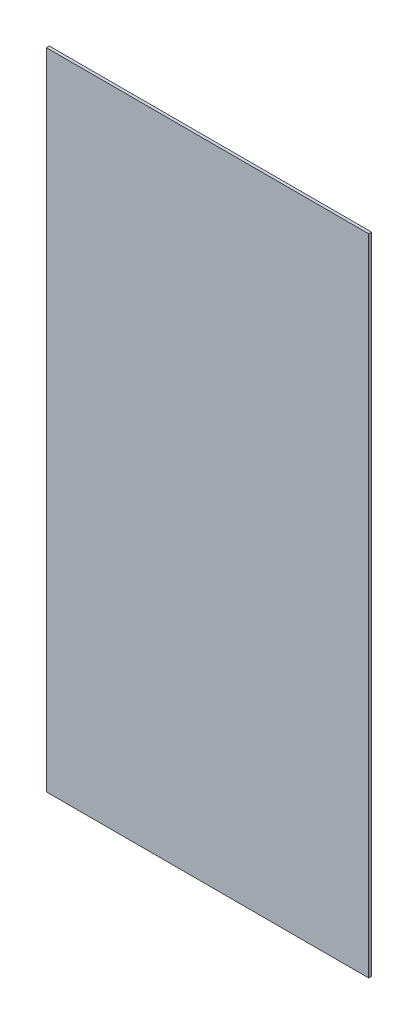
ISO-10303-21;
HEADER;
FILE_DESCRIPTION(('STEP AP214'),'2;1');
FILE_NAME('part.step','',(''),(''),'','','');
FILE_SCHEMA(('AUTOMOTIVE_DESIGN { 1 0 10303 214 1 1 1 1 }'));
ENDSEC;
DATA;
#1=APPLICATION_CONTEXT('core data for automotive mechanical design processes');
#2=APPLICATION_PROTOCOL_DEFINITION('international standard','automotive_design',2000,#1);
#3=PRODUCT_CONTEXT('',#1,'mechanical');
#4=PRODUCT('Part','Part','',(#3));
#5=PRODUCT_RELATED_PRODUCT_CATEGORY('part','',(#4));
#6=PRODUCT_DEFINITION_FORMATION('','',#4);
#7=PRODUCT_DEFINITION_CONTEXT('part definition',#1,'design');
#8=PRODUCT_DEFINITION('design','',#6,#7);
#9=PRODUCT_DEFINITION_SHAPE('','',#8);
#10=(LENGTH_UNIT() NAMED_UNIT(*) SI_UNIT(.MILLI.,.METRE.));
#11=(NAMED_UNIT(*) PLANE_ANGLE_UNIT() SI_UNIT($,.RADIAN.));
#12=(NAMED_UNIT(*) SI_UNIT($,.STERADIAN.) SOLID_ANGLE_UNIT());
#13=UNCERTAINTY_MEASURE_WITH_UNIT(LENGTH_MEASURE(1.E-05),#10,'distance_accuracy_value','');
#14=(GEOMETRIC_REPRESENTATION_CONTEXT(3) GLOBAL_UNCERTAINTY_ASSIGNED_CONTEXT((#13)) GLOBAL_UNIT_ASSIGNED_CONTEXT((#10,
#11,#12)) REPRESENTATION_CONTEXT('',''));
#15=CARTESIAN_POINT('',(0.,0.,0.));
#16=DIRECTION('',(0.,0.,1.));
#17=DIRECTION('',(1.,0.,0.));
#18=AXIS2_PLACEMENT_3D('',#15,#16,#17);
#19=CARTESIAN_POINT('',(0.,0.,11.1125));
#20=DIRECTION('',(1.,0.,0.));
#21=DIRECTION('',(0.,0.,-1.));
#22=AXIS2_PLACEMENT_3D('',#19,#20,#21);
#23=PLANE('',#22);
#24=DIRECTION('',(0.,-1.,0.));
#25=VECTOR('',#24,1.);
#26=CARTESIAN_POINT('',(0.,0.,0.));
#27=LINE('',#26,#25);
#28=CARTESIAN_POINT('',(0.,2438.4,0.));
#29=VERTEX_POINT('',#28);
#30=CARTESIAN_POINT('',(0.,0.,0.));
#31=VERTEX_POINT('',#30);
#32=EDGE_CURVE('E98',#29,#31,#27,.T.);
#33=ORIENTED_EDGE('',*,*,#32,.T.);
#34=DIRECTION('',(0.,0.,-1.));
#35=VECTOR('',#34,1.);
#36=CARTESIAN_POINT('',(0.,0.,11.1125));
#37=LINE('',#36,#35);
#38=CARTESIAN_POINT('',(0.,0.,11.1125));
#39=VERTEX_POINT('',#38);
#40=EDGE_CURVE('E11',#39,#31,#37,.T.);
#41=ORIENTED_EDGE('',*,*,#40,.F.);
#42=DIRECTION('',(0.,-1.,0.));
#43=VECTOR('',#42,1.);
#44=CARTESIAN_POINT('',(0.,0.,11.1125));
#45=LINE('',#44,#43);
#46=CARTESIAN_POINT('',(0.,2438.4,11.1125));
#47=VERTEX_POINT('',#46);
#48=EDGE_CURVE('E86',#47,#39,#45,.T.);
#49=ORIENTED_EDGE('',*,*,#48,.F.);
#50=DIRECTION('',(0.,0.,-1.));
#51=VECTOR('',#50,1.);
#52=CARTESIAN_POINT('',(0.,2438.4,11.1125));
#53=LINE('',#52,#51);
#54=EDGE_CURVE('E94',#47,#29,#53,.T.);
#55=ORIENTED_EDGE('',*,*,#54,.T.);
#56=EDGE_LOOP('',(#33,#41,#49,#55));
#57=FACE_BOUND('',#56,.T.);
#58=ADVANCED_FACE('F35',(#57),#23,.F.);
#59=CARTESIAN_POINT('',(0.,0.,11.1125));
#60=DIRECTION('',(0.,1.,0.));
#61=DIRECTION('',(0.,0.,1.));
#62=AXIS2_PLACEMENT_3D('',#59,#60,#61);
#63=PLANE('',#62);
#64=DIRECTION('',(1.,0.,0.));
#65=VECTOR('',#64,1.);
#66=CARTESIAN_POINT('',(0.,0.,0.));
#67=LINE('',#66,#65);
#68=CARTESIAN_POINT('',(1219.2,0.,0.));
#69=VERTEX_POINT('',#68);
#70=EDGE_CURVE('E90',#31,#69,#67,.T.);
#71=ORIENTED_EDGE('',*,*,#70,.T.);
#72=DIRECTION('',(0.,0.,-1.));
#73=VECTOR('',#72,1.);
#74=CARTESIAN_POINT('',(1219.2,0.,11.1125));
#75=LINE('',#74,#73);
#76=CARTESIAN_POINT('',(1219.2,0.,11.1125));
#77=VERTEX_POINT('',#76);
#78=EDGE_CURVE('E43',#77,#69,#75,.T.);
#79=ORIENTED_EDGE('',*,*,#78,.F.);
#80=DIRECTION('',(1.,0.,0.));
#81=VECTOR('',#80,1.);
#82=CARTESIAN_POINT('',(0.,0.,11.1125));
#83=LINE('',#82,#81);
#84=EDGE_CURVE('E81',#39,#77,#83,.T.);
#85=ORIENTED_EDGE('',*,*,#84,.F.);
#86=ORIENTED_EDGE('',*,*,#40,.T.);
#87=EDGE_LOOP('',(#71,#79,#85,#86));
#88=FACE_BOUND('',#87,.T.);
#89=ADVANCED_FACE('F89',(#88),#63,.F.);
#90=CARTESIAN_POINT('',(1219.2,0.,11.1125));
#91=DIRECTION('',(-1.,0.,0.));
#92=DIRECTION('',(0.,0.,1.));
#93=AXIS2_PLACEMENT_3D('',#90,#91,#92);
#94=PLANE('',#93);
#95=DIRECTION('',(0.,1.,0.));
#96=VECTOR('',#95,1.);
#97=CARTESIAN_POINT('',(1219.2,0.,0.));
#98=LINE('',#97,#96);
#99=CARTESIAN_POINT('',(1219.2,2438.4,0.));
#100=VERTEX_POINT('',#99);
#101=EDGE_CURVE('E68',#69,#100,#98,.T.);
#102=ORIENTED_EDGE('',*,*,#101,.T.);
#103=DIRECTION('',(0.,0.,-1.));
#104=VECTOR('',#103,1.);
#105=CARTESIAN_POINT('',(1219.2,2438.4,11.1125));
#106=LINE('',#105,#104);
#107=CARTESIAN_POINT('',(1219.2,2438.4,11.1125));
#108=VERTEX_POINT('',#107);
#109=EDGE_CURVE('E91',#108,#100,#106,.T.);
#110=ORIENTED_EDGE('',*,*,#109,.F.);
#111=DIRECTION('',(0.,1.,0.));
#112=VECTOR('',#111,1.);
#113=CARTESIAN_POINT('',(1219.2,0.,11.1125));
#114=LINE('',#113,#112);
#115=EDGE_CURVE('E84',#77,#108,#114,.T.);
#116=ORIENTED_EDGE('',*,*,#115,.F.);
#117=ORIENTED_EDGE('',*,*,#78,.T.);
#118=EDGE_LOOP('',(#102,#110,#116,#117));
#119=FACE_BOUND('',#118,.T.);
#120=ADVANCED_FACE('F92',(#119),#94,.F.);
#121=CARTESIAN_POINT('',(0.,2438.4,11.1125));
#122=DIRECTION('',(0.,-1.,0.));
#123=DIRECTION('',(0.,0.,-1.));
#124=AXIS2_PLACEMENT_3D('',#121,#122,#123);
#125=PLANE('',#124);
#126=DIRECTION('',(-1.,0.,0.));
#127=VECTOR('',#126,1.);
#128=CARTESIAN_POINT('',(0.,2438.4,0.));
#129=LINE('',#128,#127);
#130=EDGE_CURVE('E74',#100,#29,#129,.T.);
#131=ORIENTED_EDGE('',*,*,#130,.T.);
#132=ORIENTED_EDGE('',*,*,#54,.F.);
#133=DIRECTION('',(-1.,0.,0.));
#134=VECTOR('',#133,1.);
#135=CARTESIAN_POINT('',(0.,2438.4,11.1125));
#136=LINE('',#135,#134);
#137=EDGE_CURVE('E51',#108,#47,#136,.T.);
#138=ORIENTED_EDGE('',*,*,#137,.F.);
#139=ORIENTED_EDGE('',*,*,#109,.T.);
#140=EDGE_LOOP('',(#131,#132,#138,#139));
#141=FACE_BOUND('',#140,.T.);
#142=ADVANCED_FACE('F105',(#141),#125,.F.);
#143=CARTESIAN_POINT('',(0.,0.,11.1125));
#144=DIRECTION('',(0.,0.,-1.));
#145=DIRECTION('',(-1.,0.,0.));
#146=AXIS2_PLACEMENT_3D('',#143,#144,#145);
#147=PLANE('',#146);
#148=ORIENTED_EDGE('',*,*,#48,.T.);
#149=ORIENTED_EDGE('',*,*,#84,.T.);
#150=ORIENTED_EDGE('',*,*,#115,.T.);
#151=ORIENTED_EDGE('',*,*,#137,.T.);
#152=EDGE_LOOP('',(#148,#149,#150,#151));
#153=FACE_BOUND('',#152,.T.);
#154=ADVANCED_FACE('F82',(#153),#147,.F.);
#155=CARTESIAN_POINT('',(0.,0.,0.));
#156=DIRECTION('',(0.,0.,-1.));
#157=DIRECTION('',(-1.,0.,0.));
#158=AXIS2_PLACEMENT_3D('',#155,#156,#157);
#159=PLANE('',#158);
#160=ORIENTED_EDGE('',*,*,#32,.F.);
#161=ORIENTED_EDGE('',*,*,#130,.F.);
#162=ORIENTED_EDGE('',*,*,#101,.F.);
#163=ORIENTED_EDGE('',*,*,#70,.F.);
#164=EDGE_LOOP('',(#160,#161,#162,#163));
#165=FACE_BOUND('',#164,.T.);
#166=ADVANCED_FACE('F108',(#165),#159,.T.);
#167=CLOSED_SHELL('',(#58,#89,#120,#142,#154,#166));
#168=MANIFOLD_SOLID_BREP('B2',#167);
#169=ADVANCED_BREP_SHAPE_REPRESENTATION('',(#18,#168),#14);
#170=SHAPE_DEFINITION_REPRESENTATION(#9,#169);
ENDSEC;
END-ISO-10303-21;
